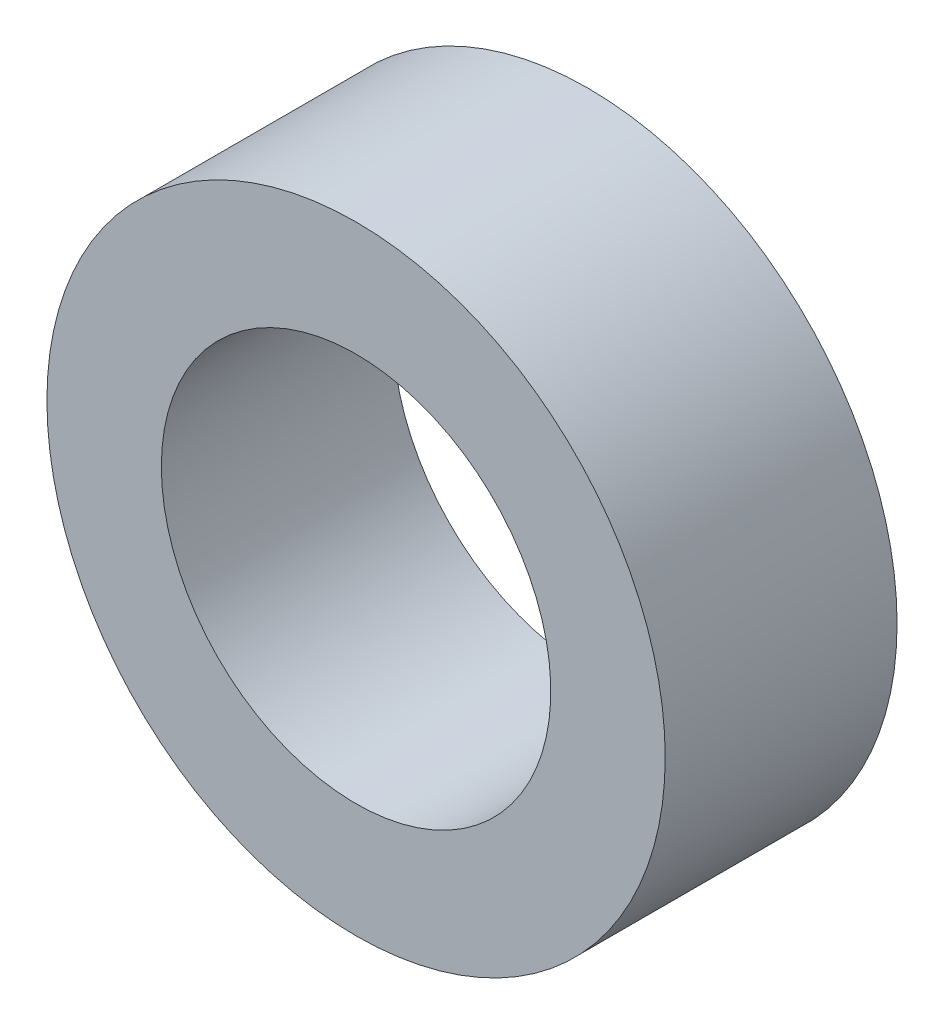
ISO-10303-21;
HEADER;
FILE_DESCRIPTION(('STEP AP214'),'2;1');
FILE_NAME('part.step','',(''),(''),'','','');
FILE_SCHEMA(('AUTOMOTIVE_DESIGN { 1 0 10303 214 1 1 1 1 }'));
ENDSEC;
DATA;
#1=APPLICATION_CONTEXT('core data for automotive mechanical design processes');
#2=APPLICATION_PROTOCOL_DEFINITION('international standard','automotive_design',2000,#1);
#3=PRODUCT_CONTEXT('',#1,'mechanical');
#4=PRODUCT('Part','Part','',(#3));
#5=PRODUCT_RELATED_PRODUCT_CATEGORY('part','',(#4));
#6=PRODUCT_DEFINITION_FORMATION('','',#4);
#7=PRODUCT_DEFINITION_CONTEXT('part definition',#1,'design');
#8=PRODUCT_DEFINITION('design','',#6,#7);
#9=PRODUCT_DEFINITION_SHAPE('','',#8);
#10=(LENGTH_UNIT() NAMED_UNIT(*) SI_UNIT(.MILLI.,.METRE.));
#11=(NAMED_UNIT(*) PLANE_ANGLE_UNIT() SI_UNIT($,.RADIAN.));
#12=(NAMED_UNIT(*) SI_UNIT($,.STERADIAN.) SOLID_ANGLE_UNIT());
#13=UNCERTAINTY_MEASURE_WITH_UNIT(LENGTH_MEASURE(1.E-05),#10,'distance_accuracy_value','');
#14=(GEOMETRIC_REPRESENTATION_CONTEXT(3) GLOBAL_UNCERTAINTY_ASSIGNED_CONTEXT((#13)) GLOBAL_UNIT_ASSIGNED_CONTEXT((#10,
#11,#12)) REPRESENTATION_CONTEXT('',''));
#15=CARTESIAN_POINT('',(0.,0.,0.));
#16=DIRECTION('',(0.,0.,1.));
#17=DIRECTION('',(1.,0.,0.));
#18=AXIS2_PLACEMENT_3D('',#15,#16,#17);
#19=CARTESIAN_POINT('',(226.780244032759,617.201596269697,1572.86741284533));
#20=DIRECTION('',(0.,0.,1.));
#21=DIRECTION('',(1.,0.,0.));
#22=AXIS2_PLACEMENT_3D('',#19,#20,#21);
#23=CYLINDRICAL_SURFACE('',#22,6.34999999999999);
#24=CARTESIAN_POINT('',(226.780244032759,617.201596269697,1572.86741284533));
#25=DIRECTION('',(0.,0.,-1.));
#26=DIRECTION('',(-1.,0.,0.));
#27=AXIS2_PLACEMENT_3D('',#24,#25,#26);
#28=CIRCLE('',#27,6.34999999999999);
#29=CARTESIAN_POINT('',(220.430244032759,617.201596269697,1572.86741284533));
#30=VERTEX_POINT('',#29);
#31=EDGE_CURVE('E10',#30,#30,#28,.T.);
#32=ORIENTED_EDGE('',*,*,#31,.F.);
#33=EDGE_LOOP('',(#32));
#34=FACE_BOUND('',#33,.T.);
#35=CARTESIAN_POINT('',(226.780244032759,617.201596269697,1577.62991284533));
#36=DIRECTION('',(0.,0.,-1.));
#37=DIRECTION('',(-1.,0.,0.));
#38=AXIS2_PLACEMENT_3D('',#35,#36,#37);
#39=CIRCLE('',#38,6.34999999999999);
#40=CARTESIAN_POINT('',(220.430244032759,617.201596269697,1577.62991284533));
#41=VERTEX_POINT('',#40);
#42=EDGE_CURVE('E37',#41,#41,#39,.T.);
#43=ORIENTED_EDGE('',*,*,#42,.T.);
#44=EDGE_LOOP('',(#43));
#45=FACE_BOUND('',#44,.T.);
#46=ADVANCED_FACE('F34',(#34,#45),#23,.T.);
#47=CARTESIAN_POINT('',(226.780244032759,617.201596269697,1572.86741284533));
#48=DIRECTION('',(0.,0.,-1.));
#49=DIRECTION('',(-1.,0.,0.));
#50=AXIS2_PLACEMENT_3D('',#47,#48,#49);
#51=PLANE('',#50);
#52=CARTESIAN_POINT('',(226.780244032759,617.201596269697,1572.86741284533));
#53=DIRECTION('',(0.,0.,-1.));
#54=DIRECTION('',(-1.,0.,0.));
#55=AXIS2_PLACEMENT_3D('',#52,#53,#54);
#56=CIRCLE('',#55,4.00000000000002);
#57=CARTESIAN_POINT('',(222.780244032759,617.201596269697,1572.86741284533));
#58=VERTEX_POINT('',#57);
#59=EDGE_CURVE('E44',#58,#58,#56,.T.);
#60=ORIENTED_EDGE('',*,*,#59,.F.);
#61=EDGE_LOOP('',(#60));
#62=FACE_BOUND('',#61,.T.);
#63=ORIENTED_EDGE('',*,*,#31,.T.);
#64=EDGE_LOOP('',(#63));
#65=FACE_BOUND('',#64,.T.);
#66=ADVANCED_FACE('F55',(#62,#65),#51,.T.);
#67=CARTESIAN_POINT('',(226.780244032759,617.201596269697,1577.62991284533));
#68=DIRECTION('',(0.,0.,-1.));
#69=DIRECTION('',(-1.,0.,0.));
#70=AXIS2_PLACEMENT_3D('',#67,#68,#69);
#71=PLANE('',#70);
#72=CARTESIAN_POINT('',(226.780244032759,617.201596269697,1577.62991284533));
#73=DIRECTION('',(0.,0.,-1.));
#74=DIRECTION('',(-1.,0.,0.));
#75=AXIS2_PLACEMENT_3D('',#72,#73,#74);
#76=CIRCLE('',#75,4.00000000000002);
#77=CARTESIAN_POINT('',(222.780244032759,617.201596269697,1577.62991284533));
#78=VERTEX_POINT('',#77);
#79=EDGE_CURVE('E46',#78,#78,#76,.T.);
#80=ORIENTED_EDGE('',*,*,#79,.T.);
#81=EDGE_LOOP('',(#80));
#82=FACE_BOUND('',#81,.T.);
#83=ORIENTED_EDGE('',*,*,#42,.F.);
#84=EDGE_LOOP('',(#83));
#85=FACE_BOUND('',#84,.T.);
#86=ADVANCED_FACE('F57',(#82,#85),#71,.F.);
#87=CARTESIAN_POINT('',(226.780244032759,617.201596269697,1572.86741284533));
#88=DIRECTION('',(0.,0.,1.));
#89=DIRECTION('',(1.,0.,0.));
#90=AXIS2_PLACEMENT_3D('',#87,#88,#89);
#91=CYLINDRICAL_SURFACE('',#90,4.00000000000002);
#92=ORIENTED_EDGE('',*,*,#59,.T.);
#93=EDGE_LOOP('',(#92));
#94=FACE_BOUND('',#93,.T.);
#95=ORIENTED_EDGE('',*,*,#79,.F.);
#96=EDGE_LOOP('',(#95));
#97=FACE_BOUND('',#96,.T.);
#98=ADVANCED_FACE('F52',(#94,#97),#91,.F.);
#99=CLOSED_SHELL('',(#46,#66,#86,#98));
#100=MANIFOLD_SOLID_BREP('B2',#99);
#101=ADVANCED_BREP_SHAPE_REPRESENTATION('',(#18,#100),#14);
#102=SHAPE_DEFINITION_REPRESENTATION(#9,#101);
ENDSEC;
END-ISO-10303-21;
